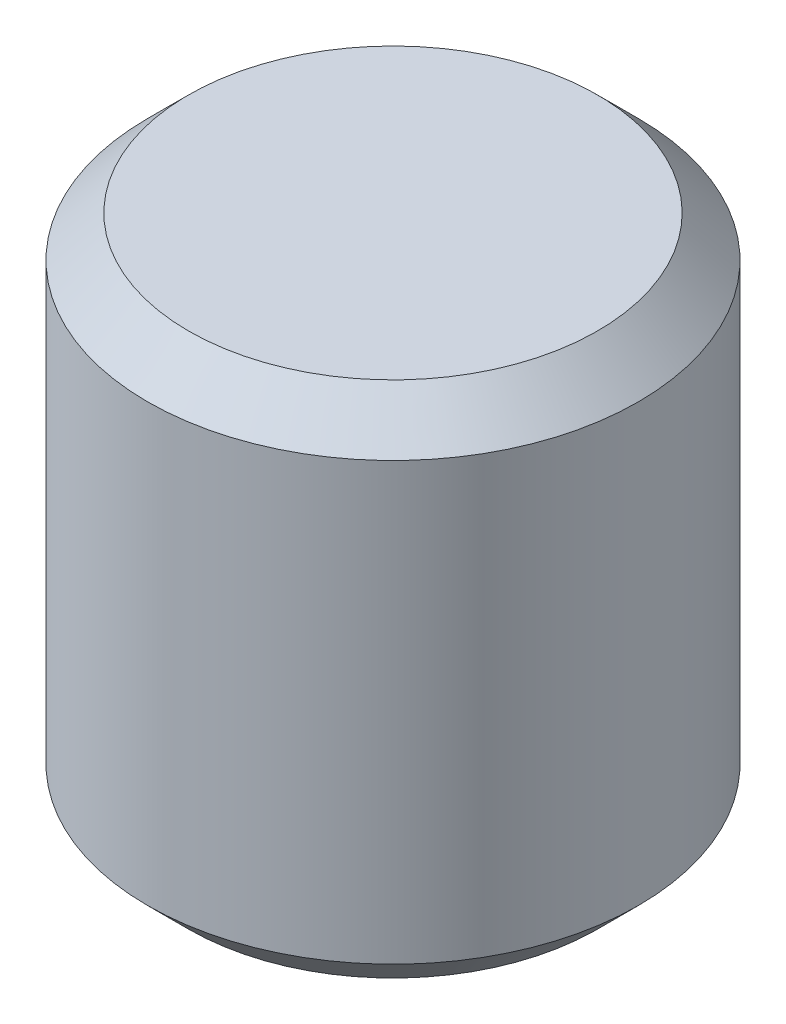
ISO-10303-21;
HEADER;
FILE_DESCRIPTION(('STEP AP214'),'2;1');
FILE_NAME('part.step','',(''),(''),'','','');
FILE_SCHEMA(('AUTOMOTIVE_DESIGN { 1 0 10303 214 1 1 1 1 }'));
ENDSEC;
DATA;
#1=APPLICATION_CONTEXT('core data for automotive mechanical design processes');
#2=APPLICATION_PROTOCOL_DEFINITION('international standard','automotive_design',2000,#1);
#3=PRODUCT_CONTEXT('',#1,'mechanical');
#4=PRODUCT('Part','Part','',(#3));
#5=PRODUCT_RELATED_PRODUCT_CATEGORY('part','',(#4));
#6=PRODUCT_DEFINITION_FORMATION('','',#4);
#7=PRODUCT_DEFINITION_CONTEXT('part definition',#1,'design');
#8=PRODUCT_DEFINITION('design','',#6,#7);
#9=PRODUCT_DEFINITION_SHAPE('','',#8);
#10=(LENGTH_UNIT() NAMED_UNIT(*) SI_UNIT(.MILLI.,.METRE.));
#11=(NAMED_UNIT(*) PLANE_ANGLE_UNIT() SI_UNIT($,.RADIAN.));
#12=(NAMED_UNIT(*) SI_UNIT($,.STERADIAN.) SOLID_ANGLE_UNIT());
#13=UNCERTAINTY_MEASURE_WITH_UNIT(LENGTH_MEASURE(1.E-05),#10,'distance_accuracy_value','');
#14=(GEOMETRIC_REPRESENTATION_CONTEXT(3) GLOBAL_UNCERTAINTY_ASSIGNED_CONTEXT((#13)) GLOBAL_UNIT_ASSIGNED_CONTEXT((#10,
#11,#12)) REPRESENTATION_CONTEXT('',''));
#15=CARTESIAN_POINT('',(0.,0.,0.));
#16=DIRECTION('',(0.,0.,1.));
#17=DIRECTION('',(1.,0.,0.));
#18=AXIS2_PLACEMENT_3D('',#15,#16,#17);
#19=CARTESIAN_POINT('',(0.,19.,0.));
#20=DIRECTION('',(0.,-1.,0.));
#21=DIRECTION('',(0.,0.,-1.));
#22=AXIS2_PLACEMENT_3D('',#19,#20,#21);
#23=CYLINDRICAL_SURFACE('',#22,9.);
#24=CARTESIAN_POINT('',(0.,1.5,0.));
#25=DIRECTION('',(0.,1.,0.));
#26=DIRECTION('',(0.,0.,1.));
#27=AXIS2_PLACEMENT_3D('',#24,#25,#26);
#28=CIRCLE('',#27,9.);
#29=CARTESIAN_POINT('',(0.,1.5,9.));
#30=VERTEX_POINT('',#29);
#31=EDGE_CURVE('E44',#30,#30,#28,.T.);
#32=ORIENTED_EDGE('',*,*,#31,.T.);
#33=EDGE_LOOP('',(#32));
#34=FACE_BOUND('',#33,.T.);
#35=CARTESIAN_POINT('',(0.,17.5,0.));
#36=DIRECTION('',(0.,1.,0.));
#37=DIRECTION('',(0.,0.,1.));
#38=AXIS2_PLACEMENT_3D('',#35,#36,#37);
#39=CIRCLE('',#38,9.);
#40=CARTESIAN_POINT('',(0.,17.5,9.));
#41=VERTEX_POINT('',#40);
#42=EDGE_CURVE('E48',#41,#41,#39,.F.);
#43=ORIENTED_EDGE('',*,*,#42,.T.);
#44=EDGE_LOOP('',(#43));
#45=FACE_BOUND('',#44,.T.);
#46=ADVANCED_FACE('F33',(#34,#45),#23,.T.);
#47=CARTESIAN_POINT('',(0.,19.,0.));
#48=DIRECTION('',(0.,1.,0.));
#49=DIRECTION('',(0.,0.,1.));
#50=AXIS2_PLACEMENT_3D('',#47,#48,#49);
#51=PLANE('',#50);
#52=CARTESIAN_POINT('',(0.,19.,0.));
#53=DIRECTION('',(0.,1.,0.));
#54=DIRECTION('',(0.,0.,1.));
#55=AXIS2_PLACEMENT_3D('',#52,#53,#54);
#56=CIRCLE('',#55,7.5);
#57=CARTESIAN_POINT('',(0.,19.,7.5));
#58=VERTEX_POINT('',#57);
#59=EDGE_CURVE('E10',#58,#58,#56,.T.);
#60=ORIENTED_EDGE('',*,*,#59,.T.);
#61=EDGE_LOOP('',(#60));
#62=FACE_BOUND('',#61,.T.);
#63=ADVANCED_FACE('F64',(#62),#51,.T.);
#64=CARTESIAN_POINT('',(0.,0.,0.));
#65=DIRECTION('',(0.,1.,0.));
#66=DIRECTION('',(0.,0.,1.));
#67=AXIS2_PLACEMENT_3D('',#64,#65,#66);
#68=PLANE('',#67);
#69=CARTESIAN_POINT('',(0.,0.,0.));
#70=DIRECTION('',(0.,1.,0.));
#71=DIRECTION('',(0.,0.,1.));
#72=AXIS2_PLACEMENT_3D('',#69,#70,#71);
#73=CIRCLE('',#72,7.5);
#74=CARTESIAN_POINT('',(0.,0.,7.5));
#75=VERTEX_POINT('',#74);
#76=EDGE_CURVE('E40',#75,#75,#73,.F.);
#77=ORIENTED_EDGE('',*,*,#76,.T.);
#78=EDGE_LOOP('',(#77));
#79=FACE_BOUND('',#78,.T.);
#80=ADVANCED_FACE('F61',(#79),#68,.F.);
#81=CARTESIAN_POINT('',(0.,1.5,0.));
#82=DIRECTION('',(0.,1.,0.));
#83=DIRECTION('',(0.,0.,1.));
#84=AXIS2_PLACEMENT_3D('',#81,#82,#83);
#85=CONICAL_SURFACE('',#84,9.,0.78539816339745);
#86=ORIENTED_EDGE('',*,*,#76,.F.);
#87=EDGE_LOOP('',(#86));
#88=FACE_BOUND('',#87,.T.);
#89=ORIENTED_EDGE('',*,*,#31,.F.);
#90=EDGE_LOOP('',(#89));
#91=FACE_BOUND('',#90,.T.);
#92=ADVANCED_FACE('F57',(#88,#91),#85,.T.);
#93=CARTESIAN_POINT('',(0.,19.,0.));
#94=DIRECTION('',(0.,-1.,0.));
#95=DIRECTION('',(0.,0.,-1.));
#96=AXIS2_PLACEMENT_3D('',#93,#94,#95);
#97=CONICAL_SURFACE('',#96,7.5,0.785398163397447);
#98=ORIENTED_EDGE('',*,*,#42,.F.);
#99=EDGE_LOOP('',(#98));
#100=FACE_BOUND('',#99,.T.);
#101=ORIENTED_EDGE('',*,*,#59,.F.);
#102=EDGE_LOOP('',(#101));
#103=FACE_BOUND('',#102,.T.);
#104=ADVANCED_FACE('F35',(#100,#103),#97,.T.);
#105=CLOSED_SHELL('',(#46,#63,#80,#92,#104));
#106=MANIFOLD_SOLID_BREP('B2',#105);
#107=ADVANCED_BREP_SHAPE_REPRESENTATION('',(#18,#106),#14);
#108=SHAPE_DEFINITION_REPRESENTATION(#9,#107);
ENDSEC;
END-ISO-10303-21;
